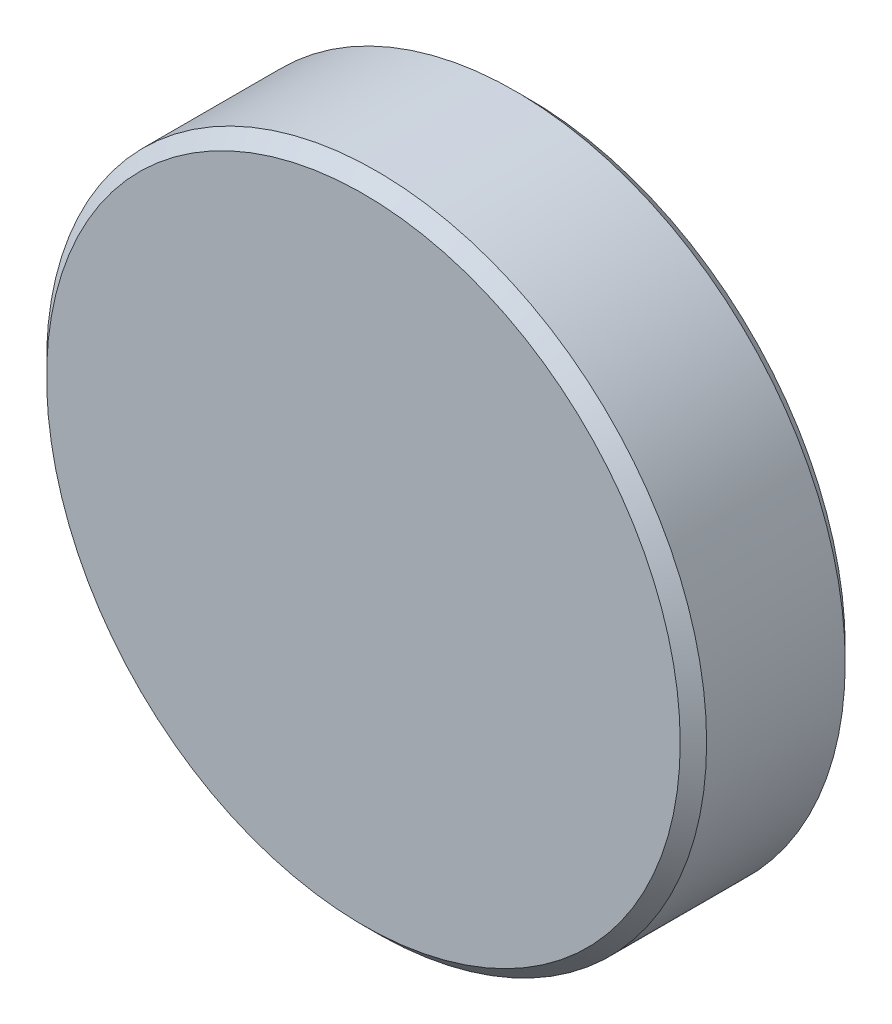
ISO-10303-21;
HEADER;
FILE_DESCRIPTION(('STEP AP214'),'2;1');
FILE_NAME('part.step','',(''),(''),'','','');
FILE_SCHEMA(('AUTOMOTIVE_DESIGN { 1 0 10303 214 1 1 1 1 }'));
ENDSEC;
DATA;
#1=APPLICATION_CONTEXT('core data for automotive mechanical design processes');
#2=APPLICATION_PROTOCOL_DEFINITION('international standard','automotive_design',2000,#1);
#3=PRODUCT_CONTEXT('',#1,'mechanical');
#4=PRODUCT('Part','Part','',(#3));
#5=PRODUCT_RELATED_PRODUCT_CATEGORY('part','',(#4));
#6=PRODUCT_DEFINITION_FORMATION('','',#4);
#7=PRODUCT_DEFINITION_CONTEXT('part definition',#1,'design');
#8=PRODUCT_DEFINITION('design','',#6,#7);
#9=PRODUCT_DEFINITION_SHAPE('','',#8);
#10=(LENGTH_UNIT() NAMED_UNIT(*) SI_UNIT(.MILLI.,.METRE.));
#11=(NAMED_UNIT(*) PLANE_ANGLE_UNIT() SI_UNIT($,.RADIAN.));
#12=(NAMED_UNIT(*) SI_UNIT($,.STERADIAN.) SOLID_ANGLE_UNIT());
#13=UNCERTAINTY_MEASURE_WITH_UNIT(LENGTH_MEASURE(1.E-05),#10,'distance_accuracy_value','');
#14=(GEOMETRIC_REPRESENTATION_CONTEXT(3) GLOBAL_UNCERTAINTY_ASSIGNED_CONTEXT((#13)) GLOBAL_UNIT_ASSIGNED_CONTEXT((#10,
#11,#12)) REPRESENTATION_CONTEXT('',''));
#15=CARTESIAN_POINT('',(0.,0.,0.));
#16=DIRECTION('',(0.,0.,1.));
#17=DIRECTION('',(1.,0.,0.));
#18=AXIS2_PLACEMENT_3D('',#15,#16,#17);
#19=CARTESIAN_POINT('',(0.,0.,50.));
#20=DIRECTION('',(0.,0.,-1.));
#21=DIRECTION('',(-1.,0.,0.));
#22=AXIS2_PLACEMENT_3D('',#19,#20,#21);
#23=CYLINDRICAL_SURFACE('',#22,100.);
#24=CARTESIAN_POINT('',(0.,0.,46.));
#25=DIRECTION('',(0.,0.,1.));
#26=DIRECTION('',(1.,0.,0.));
#27=AXIS2_PLACEMENT_3D('',#24,#25,#26);
#28=CIRCLE('',#27,100.);
#29=CARTESIAN_POINT('',(100.,0.,46.));
#30=VERTEX_POINT('',#29);
#31=EDGE_CURVE('E10',#30,#30,#28,.F.);
#32=ORIENTED_EDGE('',*,*,#31,.T.);
#33=EDGE_LOOP('',(#32));
#34=FACE_BOUND('',#33,.T.);
#35=CARTESIAN_POINT('',(0.,0.,4.));
#36=DIRECTION('',(0.,0.,1.));
#37=DIRECTION('',(1.,0.,0.));
#38=AXIS2_PLACEMENT_3D('',#35,#36,#37);
#39=CIRCLE('',#38,100.);
#40=CARTESIAN_POINT('',(100.,0.,4.));
#41=VERTEX_POINT('',#40);
#42=EDGE_CURVE('E46',#41,#41,#39,.T.);
#43=ORIENTED_EDGE('',*,*,#42,.T.);
#44=EDGE_LOOP('',(#43));
#45=FACE_BOUND('',#44,.T.);
#46=ADVANCED_FACE('F31',(#34,#45),#23,.T.);
#47=CARTESIAN_POINT('',(0.,0.,50.));
#48=DIRECTION('',(0.,0.,1.));
#49=DIRECTION('',(1.,0.,0.));
#50=AXIS2_PLACEMENT_3D('',#47,#48,#49);
#51=PLANE('',#50);
#52=CARTESIAN_POINT('',(0.,0.,50.));
#53=DIRECTION('',(0.,0.,1.));
#54=DIRECTION('',(1.,0.,0.));
#55=AXIS2_PLACEMENT_3D('',#52,#53,#54);
#56=CIRCLE('',#55,96.);
#57=CARTESIAN_POINT('',(96.,0.,50.));
#58=VERTEX_POINT('',#57);
#59=EDGE_CURVE('E38',#58,#58,#56,.T.);
#60=ORIENTED_EDGE('',*,*,#59,.T.);
#61=EDGE_LOOP('',(#60));
#62=FACE_BOUND('',#61,.T.);
#63=ADVANCED_FACE('F62',(#62),#51,.T.);
#64=CARTESIAN_POINT('',(0.,0.,0.));
#65=DIRECTION('',(0.,0.,1.));
#66=DIRECTION('',(1.,0.,0.));
#67=AXIS2_PLACEMENT_3D('',#64,#65,#66);
#68=PLANE('',#67);
#69=CARTESIAN_POINT('',(0.,0.,0.));
#70=DIRECTION('',(0.,0.,1.));
#71=DIRECTION('',(1.,0.,0.));
#72=AXIS2_PLACEMENT_3D('',#69,#70,#71);
#73=CIRCLE('',#72,96.);
#74=CARTESIAN_POINT('',(96.,0.,0.));
#75=VERTEX_POINT('',#74);
#76=EDGE_CURVE('E42',#75,#75,#73,.F.);
#77=ORIENTED_EDGE('',*,*,#76,.T.);
#78=EDGE_LOOP('',(#77));
#79=FACE_BOUND('',#78,.T.);
#80=ADVANCED_FACE('F55',(#79),#68,.F.);
#81=CARTESIAN_POINT('',(0.,0.,4.));
#82=DIRECTION('',(0.,0.,1.));
#83=DIRECTION('',(1.,0.,0.));
#84=AXIS2_PLACEMENT_3D('',#81,#82,#83);
#85=CONICAL_SURFACE('',#84,100.,0.78539816339745);
#86=ORIENTED_EDGE('',*,*,#76,.F.);
#87=EDGE_LOOP('',(#86));
#88=FACE_BOUND('',#87,.T.);
#89=ORIENTED_EDGE('',*,*,#42,.F.);
#90=EDGE_LOOP('',(#89));
#91=FACE_BOUND('',#90,.T.);
#92=ADVANCED_FACE('F53',(#88,#91),#85,.T.);
#93=CARTESIAN_POINT('',(0.,0.,50.));
#94=DIRECTION('',(0.,0.,-1.));
#95=DIRECTION('',(-1.,0.,0.));
#96=AXIS2_PLACEMENT_3D('',#93,#94,#95);
#97=CONICAL_SURFACE('',#96,96.,0.785398163397445);
#98=ORIENTED_EDGE('',*,*,#31,.F.);
#99=EDGE_LOOP('',(#98));
#100=FACE_BOUND('',#99,.T.);
#101=ORIENTED_EDGE('',*,*,#59,.F.);
#102=EDGE_LOOP('',(#101));
#103=FACE_BOUND('',#102,.T.);
#104=ADVANCED_FACE('F33',(#100,#103),#97,.T.);
#105=CLOSED_SHELL('',(#46,#63,#80,#92,#104));
#106=MANIFOLD_SOLID_BREP('B2',#105);
#107=ADVANCED_BREP_SHAPE_REPRESENTATION('',(#18,#106),#14);
#108=SHAPE_DEFINITION_REPRESENTATION(#9,#107);
ENDSEC;
END-ISO-10303-21;
